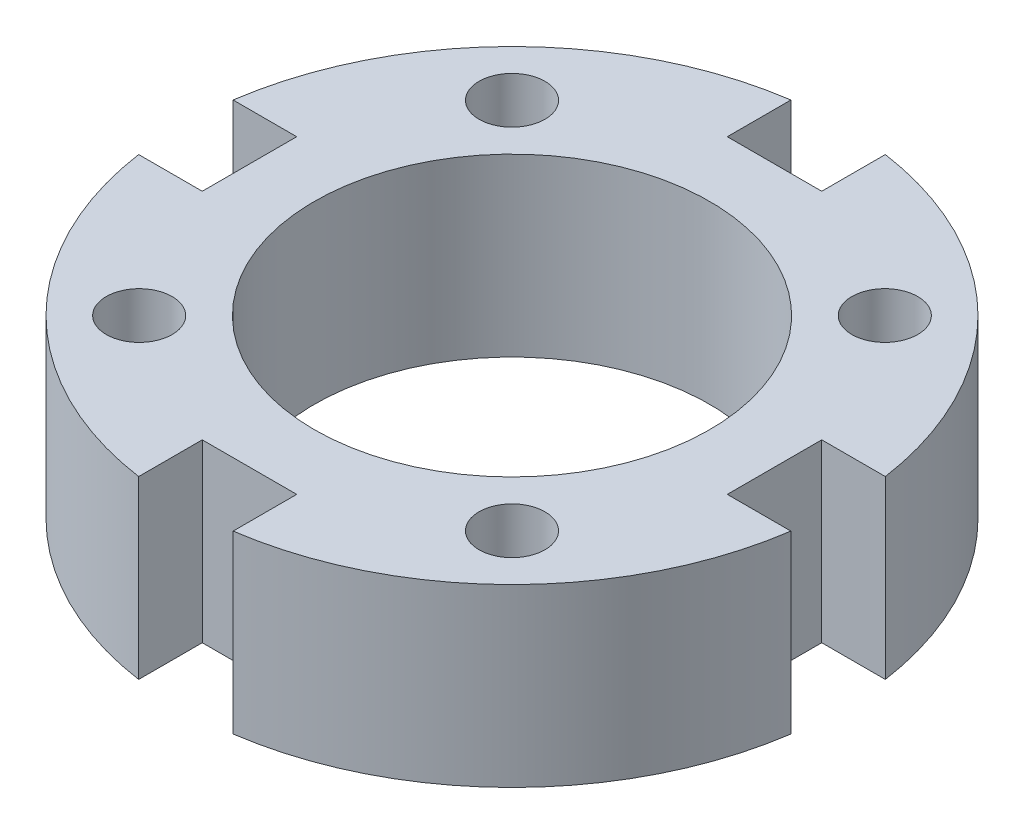
ISO-10303-21;
HEADER;
FILE_DESCRIPTION(('STEP AP214'),'2;1');
FILE_NAME('part.step','',(''),(''),'','','');
FILE_SCHEMA(('AUTOMOTIVE_DESIGN { 1 0 10303 214 1 1 1 1 }'));
ENDSEC;
DATA;
#1=APPLICATION_CONTEXT('core data for automotive mechanical design processes');
#2=APPLICATION_PROTOCOL_DEFINITION('international standard','automotive_design',2000,#1);
#3=PRODUCT_CONTEXT('',#1,'mechanical');
#4=PRODUCT('Part','Part','',(#3));
#5=PRODUCT_RELATED_PRODUCT_CATEGORY('part','',(#4));
#6=PRODUCT_DEFINITION_FORMATION('','',#4);
#7=PRODUCT_DEFINITION_CONTEXT('part definition',#1,'design');
#8=PRODUCT_DEFINITION('design','',#6,#7);
#9=PRODUCT_DEFINITION_SHAPE('','',#8);
#10=(LENGTH_UNIT() NAMED_UNIT(*) SI_UNIT(.MILLI.,.METRE.));
#11=(NAMED_UNIT(*) PLANE_ANGLE_UNIT() SI_UNIT($,.RADIAN.));
#12=(NAMED_UNIT(*) SI_UNIT($,.STERADIAN.) SOLID_ANGLE_UNIT());
#13=UNCERTAINTY_MEASURE_WITH_UNIT(LENGTH_MEASURE(1.E-05),#10,'distance_accuracy_value','');
#14=(GEOMETRIC_REPRESENTATION_CONTEXT(3) GLOBAL_UNCERTAINTY_ASSIGNED_CONTEXT((#13)) GLOBAL_UNIT_ASSIGNED_CONTEXT((#10,
#11,#12)) REPRESENTATION_CONTEXT('',''));
#15=CARTESIAN_POINT('',(0.,0.,0.));
#16=DIRECTION('',(0.,0.,1.));
#17=DIRECTION('',(1.,0.,0.));
#18=AXIS2_PLACEMENT_3D('',#15,#16,#17);
#19=CARTESIAN_POINT('',(0.,4.,0.));
#20=DIRECTION('',(0.,1.,0.));
#21=DIRECTION('',(0.,0.,1.));
#22=AXIS2_PLACEMENT_3D('',#19,#20,#21);
#23=PLANE('',#22);
#24=CARTESIAN_POINT('',(4.24264068711925,4.,-4.24264068711932));
#25=DIRECTION('',(0.,-1.,0.));
#26=DIRECTION('',(-1.,0.,0.));
#27=AXIS2_PLACEMENT_3D('',#24,#25,#26);
#28=CIRCLE('',#27,0.749999999999997);
#29=CARTESIAN_POINT('',(3.49264068711925,4.,-4.24264068711932));
#30=VERTEX_POINT('',#29);
#31=EDGE_CURVE('E383',#30,#30,#28,.T.);
#32=ORIENTED_EDGE('',*,*,#31,.T.);
#33=EDGE_LOOP('',(#32));
#34=FACE_BOUND('',#33,.T.);
#35=CARTESIAN_POINT('',(-4.24264068711931,4.,-4.24264068711926));
#36=DIRECTION('',(0.,-1.,0.));
#37=DIRECTION('',(0.,0.,1.));
#38=AXIS2_PLACEMENT_3D('',#35,#36,#37);
#39=CIRCLE('',#38,0.749999999999997);
#40=CARTESIAN_POINT('',(-4.24264068711931,4.,-3.49264068711927));
#41=VERTEX_POINT('',#40);
#42=EDGE_CURVE('E387',#41,#41,#39,.T.);
#43=ORIENTED_EDGE('',*,*,#42,.T.);
#44=EDGE_LOOP('',(#43));
#45=FACE_BOUND('',#44,.T.);
#46=CARTESIAN_POINT('',(-4.24264068711922,4.,4.24264068711935));
#47=DIRECTION('',(0.,-1.,0.));
#48=DIRECTION('',(1.,0.,0.));
#49=AXIS2_PLACEMENT_3D('',#46,#47,#48);
#50=CIRCLE('',#49,0.749999999999997);
#51=CARTESIAN_POINT('',(-3.49264068711922,4.,4.24264068711934));
#52=VERTEX_POINT('',#51);
#53=EDGE_CURVE('E397',#52,#52,#50,.T.);
#54=ORIENTED_EDGE('',*,*,#53,.T.);
#55=EDGE_LOOP('',(#54));
#56=FACE_BOUND('',#55,.T.);
#57=CARTESIAN_POINT('',(4.24264068711931,4.,4.24264068711926));
#58=DIRECTION('',(0.,-1.,0.));
#59=DIRECTION('',(0.,0.,-1.));
#60=AXIS2_PLACEMENT_3D('',#57,#58,#59);
#61=CIRCLE('',#60,0.749999999999997);
#62=CARTESIAN_POINT('',(4.24264068711931,4.,3.49264068711927));
#63=VERTEX_POINT('',#62);
#64=EDGE_CURVE('E217',#63,#63,#61,.T.);
#65=ORIENTED_EDGE('',*,*,#64,.T.);
#66=EDGE_LOOP('',(#65));
#67=FACE_BOUND('',#66,.T.);
#68=CARTESIAN_POINT('',(0.,4.,0.));
#69=DIRECTION('',(0.,1.,0.));
#70=DIRECTION('',(0.,0.,1.));
#71=AXIS2_PLACEMENT_3D('',#68,#69,#70);
#72=CIRCLE('',#71,4.5);
#73=CARTESIAN_POINT('',(0.,4.,4.5));
#74=VERTEX_POINT('',#73);
#75=EDGE_CURVE('E247',#74,#74,#72,.T.);
#76=ORIENTED_EDGE('',*,*,#75,.F.);
#77=EDGE_LOOP('',(#76));
#78=FACE_BOUND('',#77,.T.);
#79=CARTESIAN_POINT('',(0.,4.,0.));
#80=DIRECTION('',(0.,1.,0.));
#81=DIRECTION('',(0.,0.,1.));
#82=AXIS2_PLACEMENT_3D('',#79,#80,#81);
#83=CIRCLE('',#82,7.5);
#84=CARTESIAN_POINT('',(1.075,4.,7.42255852115697));
#85=VERTEX_POINT('',#84);
#86=CARTESIAN_POINT('',(7.42255852115698,4.,1.07499999999997));
#87=VERTEX_POINT('',#86);
#88=EDGE_CURVE('E253',#85,#87,#83,.T.);
#89=ORIENTED_EDGE('',*,*,#88,.T.);
#90=DIRECTION('',(1.,0.,0.));
#91=VECTOR('',#90,1.);
#92=CARTESIAN_POINT('',(5.97499999997551,4.,1.07499999999998));
#93=LINE('',#92,#91);
#94=CARTESIAN_POINT('',(5.97499999997551,4.,1.07499999999998));
#95=VERTEX_POINT('',#94);
#96=EDGE_CURVE('E174',#95,#87,#93,.T.);
#97=ORIENTED_EDGE('',*,*,#96,.F.);
#98=DIRECTION('',(0.,0.,-1.));
#99=VECTOR('',#98,1.);
#100=CARTESIAN_POINT('',(5.97499999997551,4.,1.07499999999998));
#101=LINE('',#100,#99);
#102=CARTESIAN_POINT('',(5.9749999999755,4.,-1.07500000000002));
#103=VERTEX_POINT('',#102);
#104=EDGE_CURVE('E173',#95,#103,#101,.T.);
#105=ORIENTED_EDGE('',*,*,#104,.T.);
#106=DIRECTION('',(1.,0.,0.));
#107=VECTOR('',#106,1.);
#108=CARTESIAN_POINT('',(5.9749999999755,4.,-1.07500000000002));
#109=LINE('',#108,#107);
#110=CARTESIAN_POINT('',(7.42255852115697,4.,-1.07500000000003));
#111=VERTEX_POINT('',#110);
#112=EDGE_CURVE('E165',#103,#111,#109,.T.);
#113=ORIENTED_EDGE('',*,*,#112,.T.);
#114=CARTESIAN_POINT('',(1.075,4.,-7.42255852115697));
#115=VERTEX_POINT('',#114);
#116=EDGE_CURVE('E257',#111,#115,#83,.T.);
#117=ORIENTED_EDGE('',*,*,#116,.T.);
#118=DIRECTION('',(0.,0.,-1.));
#119=VECTOR('',#118,1.);
#120=CARTESIAN_POINT('',(1.075,4.,-5.97499999997551));
#121=LINE('',#120,#119);
#122=CARTESIAN_POINT('',(1.075,4.,-5.97499999997551));
#123=VERTEX_POINT('',#122);
#124=EDGE_CURVE('E192',#123,#115,#121,.T.);
#125=ORIENTED_EDGE('',*,*,#124,.F.);
#126=DIRECTION('',(-1.,0.,0.));
#127=VECTOR('',#126,1.);
#128=CARTESIAN_POINT('',(1.075,4.,-5.97499999997551));
#129=LINE('',#128,#127);
#130=CARTESIAN_POINT('',(-1.075,4.,-5.97499999997551));
#131=VERTEX_POINT('',#130);
#132=EDGE_CURVE('E202',#123,#131,#129,.T.);
#133=ORIENTED_EDGE('',*,*,#132,.T.);
#134=DIRECTION('',(0.,0.,-1.));
#135=VECTOR('',#134,1.);
#136=CARTESIAN_POINT('',(-1.075,4.,-5.97499999997551));
#137=LINE('',#136,#135);
#138=CARTESIAN_POINT('',(-1.075,4.,-7.42255852115697));
#139=VERTEX_POINT('',#138);
#140=EDGE_CURVE('E189',#131,#139,#137,.T.);
#141=ORIENTED_EDGE('',*,*,#140,.T.);
#142=CARTESIAN_POINT('',(-7.42255852115698,4.,-1.07499999999992));
#143=VERTEX_POINT('',#142);
#144=EDGE_CURVE('E410',#139,#143,#83,.T.);
#145=ORIENTED_EDGE('',*,*,#144,.T.);
#146=DIRECTION('',(-1.,0.,0.));
#147=VECTOR('',#146,1.);
#148=CARTESIAN_POINT('',(-5.97499999997552,4.,-1.07499999999994));
#149=LINE('',#148,#147);
#150=CARTESIAN_POINT('',(-5.97499999997552,4.,-1.07499999999994));
#151=VERTEX_POINT('',#150);
#152=EDGE_CURVE('E212',#151,#143,#149,.T.);
#153=ORIENTED_EDGE('',*,*,#152,.F.);
#154=DIRECTION('',(0.,0.,1.));
#155=VECTOR('',#154,1.);
#156=CARTESIAN_POINT('',(-5.97499999997552,4.,-1.07499999999994));
#157=LINE('',#156,#155);
#158=CARTESIAN_POINT('',(-5.9749999999755,4.,1.07500000000006));
#159=VERTEX_POINT('',#158);
#160=EDGE_CURVE('E197',#151,#159,#157,.T.);
#161=ORIENTED_EDGE('',*,*,#160,.T.);
#162=DIRECTION('',(-1.,0.,0.));
#163=VECTOR('',#162,1.);
#164=CARTESIAN_POINT('',(-5.9749999999755,4.,1.07500000000006));
#165=LINE('',#164,#163);
#166=CARTESIAN_POINT('',(-7.42255852115696,4.,1.07500000000008));
#167=VERTEX_POINT('',#166);
#168=EDGE_CURVE('E209',#159,#167,#165,.T.);
#169=ORIENTED_EDGE('',*,*,#168,.T.);
#170=CARTESIAN_POINT('',(-1.075,4.,7.42255852115697));
#171=VERTEX_POINT('',#170);
#172=EDGE_CURVE('E258',#167,#171,#83,.T.);
#173=ORIENTED_EDGE('',*,*,#172,.T.);
#174=DIRECTION('',(0.,0.,1.));
#175=VECTOR('',#174,1.);
#176=CARTESIAN_POINT('',(-1.075,4.,5.97499999997551));
#177=LINE('',#176,#175);
#178=CARTESIAN_POINT('',(-1.075,4.,5.97499999997551));
#179=VERTEX_POINT('',#178);
#180=EDGE_CURVE('E231',#179,#171,#177,.T.);
#181=ORIENTED_EDGE('',*,*,#180,.F.);
#182=DIRECTION('',(1.,0.,0.));
#183=VECTOR('',#182,1.);
#184=CARTESIAN_POINT('',(-1.075,4.,5.97499999997551));
#185=LINE('',#184,#183);
#186=CARTESIAN_POINT('',(1.075,4.,5.97499999997551));
#187=VERTEX_POINT('',#186);
#188=EDGE_CURVE('E242',#179,#187,#185,.T.);
#189=ORIENTED_EDGE('',*,*,#188,.T.);
#190=DIRECTION('',(0.,0.,1.));
#191=VECTOR('',#190,1.);
#192=CARTESIAN_POINT('',(1.075,4.,5.97499999997551));
#193=LINE('',#192,#191);
#194=EDGE_CURVE('E228',#187,#85,#193,.T.);
#195=ORIENTED_EDGE('',*,*,#194,.T.);
#196=EDGE_LOOP('',(#89,#97,#105,#113,#117,#125,#133,#141,#145,#153,#161,#169,#173,#181,#189,#195));
#197=FACE_BOUND('',#196,.T.);
#198=ADVANCED_FACE('F41',(#34,#45,#56,#67,#78,#197),#23,.T.);
#199=CARTESIAN_POINT('',(0.,0.,0.));
#200=DIRECTION('',(0.,1.,0.));
#201=DIRECTION('',(0.,0.,1.));
#202=AXIS2_PLACEMENT_3D('',#199,#200,#201);
#203=PLANE('',#202);
#204=CARTESIAN_POINT('',(4.24264068711925,0.,-4.24264068711932));
#205=DIRECTION('',(0.,-1.,0.));
#206=DIRECTION('',(-1.,0.,0.));
#207=AXIS2_PLACEMENT_3D('',#204,#205,#206);
#208=CIRCLE('',#207,0.749999999999997);
#209=CARTESIAN_POINT('',(3.49264068711925,0.,-4.24264068711932));
#210=VERTEX_POINT('',#209);
#211=EDGE_CURVE('E386',#210,#210,#208,.T.);
#212=ORIENTED_EDGE('',*,*,#211,.F.);
#213=EDGE_LOOP('',(#212));
#214=FACE_BOUND('',#213,.T.);
#215=CARTESIAN_POINT('',(-4.24264068711931,0.,-4.24264068711926));
#216=DIRECTION('',(0.,-1.,0.));
#217=DIRECTION('',(0.,0.,1.));
#218=AXIS2_PLACEMENT_3D('',#215,#216,#217);
#219=CIRCLE('',#218,0.749999999999997);
#220=CARTESIAN_POINT('',(-4.24264068711931,0.,-3.49264068711927));
#221=VERTEX_POINT('',#220);
#222=EDGE_CURVE('E392',#221,#221,#219,.T.);
#223=ORIENTED_EDGE('',*,*,#222,.F.);
#224=EDGE_LOOP('',(#223));
#225=FACE_BOUND('',#224,.T.);
#226=CARTESIAN_POINT('',(-4.24264068711922,0.,4.24264068711935));
#227=DIRECTION('',(0.,-1.,0.));
#228=DIRECTION('',(1.,0.,0.));
#229=AXIS2_PLACEMENT_3D('',#226,#227,#228);
#230=CIRCLE('',#229,0.749999999999997);
#231=CARTESIAN_POINT('',(-3.49264068711922,0.,4.24264068711934));
#232=VERTEX_POINT('',#231);
#233=EDGE_CURVE('E400',#232,#232,#230,.T.);
#234=ORIENTED_EDGE('',*,*,#233,.F.);
#235=EDGE_LOOP('',(#234));
#236=FACE_BOUND('',#235,.T.);
#237=CARTESIAN_POINT('',(4.24264068711931,0.,4.24264068711926));
#238=DIRECTION('',(0.,-1.,0.));
#239=DIRECTION('',(0.,0.,-1.));
#240=AXIS2_PLACEMENT_3D('',#237,#238,#239);
#241=CIRCLE('',#240,0.749999999999997);
#242=CARTESIAN_POINT('',(4.24264068711931,0.,3.49264068711927));
#243=VERTEX_POINT('',#242);
#244=EDGE_CURVE('E389',#243,#243,#241,.T.);
#245=ORIENTED_EDGE('',*,*,#244,.F.);
#246=EDGE_LOOP('',(#245));
#247=FACE_BOUND('',#246,.T.);
#248=CARTESIAN_POINT('',(0.,0.,0.));
#249=DIRECTION('',(0.,1.,0.));
#250=DIRECTION('',(0.,0.,1.));
#251=AXIS2_PLACEMENT_3D('',#248,#249,#250);
#252=CIRCLE('',#251,4.5);
#253=CARTESIAN_POINT('',(0.,0.,4.5));
#254=VERTEX_POINT('',#253);
#255=EDGE_CURVE('E245',#254,#254,#252,.T.);
#256=ORIENTED_EDGE('',*,*,#255,.T.);
#257=EDGE_LOOP('',(#256));
#258=FACE_BOUND('',#257,.T.);
#259=DIRECTION('',(-1.,0.,0.));
#260=VECTOR('',#259,1.);
#261=CARTESIAN_POINT('',(7.49999999997551,0.,1.07499999999997));
#262=LINE('',#261,#260);
#263=CARTESIAN_POINT('',(7.42255852115698,0.,1.07499999999997));
#264=VERTEX_POINT('',#263);
#265=CARTESIAN_POINT('',(5.97499999997551,0.,1.07499999999998));
#266=VERTEX_POINT('',#265);
#267=EDGE_CURVE('E155',#264,#266,#262,.T.);
#268=ORIENTED_EDGE('',*,*,#267,.F.);
#269=CARTESIAN_POINT('',(0.,0.,0.));
#270=DIRECTION('',(0.,1.,0.));
#271=DIRECTION('',(0.,0.,1.));
#272=AXIS2_PLACEMENT_3D('',#269,#270,#271);
#273=CIRCLE('',#272,7.5);
#274=CARTESIAN_POINT('',(1.075,0.,7.42255852115697));
#275=VERTEX_POINT('',#274);
#276=EDGE_CURVE('E259',#275,#264,#273,.T.);
#277=ORIENTED_EDGE('',*,*,#276,.F.);
#278=DIRECTION('',(0.,0.,-1.));
#279=VECTOR('',#278,1.);
#280=CARTESIAN_POINT('',(1.075,0.,7.49999999997551));
#281=LINE('',#280,#279);
#282=CARTESIAN_POINT('',(1.075,0.,5.97499999997551));
#283=VERTEX_POINT('',#282);
#284=EDGE_CURVE('E181',#275,#283,#281,.T.);
#285=ORIENTED_EDGE('',*,*,#284,.T.);
#286=DIRECTION('',(1.,0.,0.));
#287=VECTOR('',#286,1.);
#288=CARTESIAN_POINT('',(-1.075,0.,5.97499999997551));
#289=LINE('',#288,#287);
#290=CARTESIAN_POINT('',(-1.075,0.,5.97499999997551));
#291=VERTEX_POINT('',#290);
#292=EDGE_CURVE('E234',#291,#283,#289,.T.);
#293=ORIENTED_EDGE('',*,*,#292,.F.);
#294=DIRECTION('',(0.,0.,-1.));
#295=VECTOR('',#294,1.);
#296=CARTESIAN_POINT('',(-1.075,0.,7.49999999997551));
#297=LINE('',#296,#295);
#298=CARTESIAN_POINT('',(-1.075,0.,7.42255852115697));
#299=VERTEX_POINT('',#298);
#300=EDGE_CURVE('E225',#299,#291,#297,.T.);
#301=ORIENTED_EDGE('',*,*,#300,.F.);
#302=CARTESIAN_POINT('',(-7.42255852115696,0.,1.07500000000008));
#303=VERTEX_POINT('',#302);
#304=EDGE_CURVE('E250',#303,#299,#273,.T.);
#305=ORIENTED_EDGE('',*,*,#304,.F.);
#306=DIRECTION('',(1.,0.,0.));
#307=VECTOR('',#306,1.);
#308=CARTESIAN_POINT('',(-7.4999999999755,0.,1.07500000000008));
#309=LINE('',#308,#307);
#310=CARTESIAN_POINT('',(-5.9749999999755,0.,1.07500000000006));
#311=VERTEX_POINT('',#310);
#312=EDGE_CURVE('E56',#303,#311,#309,.T.);
#313=ORIENTED_EDGE('',*,*,#312,.T.);
#314=DIRECTION('',(0.,0.,1.));
#315=VECTOR('',#314,1.);
#316=CARTESIAN_POINT('',(-5.97499999997552,0.,-1.07499999999994));
#317=LINE('',#316,#315);
#318=CARTESIAN_POINT('',(-5.97499999997552,0.,-1.07499999999994));
#319=VERTEX_POINT('',#318);
#320=EDGE_CURVE('E214',#319,#311,#317,.T.);
#321=ORIENTED_EDGE('',*,*,#320,.F.);
#322=DIRECTION('',(1.,0.,0.));
#323=VECTOR('',#322,1.);
#324=CARTESIAN_POINT('',(-7.49999999997552,0.,-1.07499999999992));
#325=LINE('',#324,#323);
#326=CARTESIAN_POINT('',(-7.42255852115698,0.,-1.07499999999992));
#327=VERTEX_POINT('',#326);
#328=EDGE_CURVE('E206',#327,#319,#325,.T.);
#329=ORIENTED_EDGE('',*,*,#328,.F.);
#330=CARTESIAN_POINT('',(-1.075,0.,-7.42255852115697));
#331=VERTEX_POINT('',#330);
#332=EDGE_CURVE('E285',#331,#327,#273,.T.);
#333=ORIENTED_EDGE('',*,*,#332,.F.);
#334=DIRECTION('',(0.,0.,1.));
#335=VECTOR('',#334,1.);
#336=CARTESIAN_POINT('',(-1.075,0.,-7.49999999997551));
#337=LINE('',#336,#335);
#338=CARTESIAN_POINT('',(-1.075,0.,-5.97499999997551));
#339=VERTEX_POINT('',#338);
#340=EDGE_CURVE('E64',#331,#339,#337,.T.);
#341=ORIENTED_EDGE('',*,*,#340,.T.);
#342=DIRECTION('',(-1.,0.,0.));
#343=VECTOR('',#342,1.);
#344=CARTESIAN_POINT('',(1.075,0.,-5.97499999997551));
#345=LINE('',#344,#343);
#346=CARTESIAN_POINT('',(1.075,0.,-5.97499999997551));
#347=VERTEX_POINT('',#346);
#348=EDGE_CURVE('E194',#347,#339,#345,.T.);
#349=ORIENTED_EDGE('',*,*,#348,.F.);
#350=DIRECTION('',(0.,0.,1.));
#351=VECTOR('',#350,1.);
#352=CARTESIAN_POINT('',(1.075,0.,-7.49999999997551));
#353=LINE('',#352,#351);
#354=CARTESIAN_POINT('',(1.075,0.,-7.42255852115697));
#355=VERTEX_POINT('',#354);
#356=EDGE_CURVE('E186',#355,#347,#353,.T.);
#357=ORIENTED_EDGE('',*,*,#356,.F.);
#358=CARTESIAN_POINT('',(7.42255852115697,0.,-1.07500000000003));
#359=VERTEX_POINT('',#358);
#360=EDGE_CURVE('E261',#359,#355,#273,.T.);
#361=ORIENTED_EDGE('',*,*,#360,.F.);
#362=DIRECTION('',(-1.,0.,0.));
#363=VECTOR('',#362,1.);
#364=CARTESIAN_POINT('',(7.4999999999755,0.,-1.07500000000003));
#365=LINE('',#364,#363);
#366=CARTESIAN_POINT('',(5.9749999999755,0.,-1.07500000000002));
#367=VERTEX_POINT('',#366);
#368=EDGE_CURVE('E179',#359,#367,#365,.T.);
#369=ORIENTED_EDGE('',*,*,#368,.T.);
#370=DIRECTION('',(0.,0.,-1.));
#371=VECTOR('',#370,1.);
#372=CARTESIAN_POINT('',(5.97499999997551,0.,1.07499999999998));
#373=LINE('',#372,#371);
#374=EDGE_CURVE('E170',#266,#367,#373,.T.);
#375=ORIENTED_EDGE('',*,*,#374,.F.);
#376=EDGE_LOOP('',(#268,#277,#285,#293,#301,#305,#313,#321,#329,#333,#341,#349,#357,#361,#369,#375));
#377=FACE_BOUND('',#376,.T.);
#378=ADVANCED_FACE('F177',(#214,#225,#236,#247,#258,#377),#203,.F.);
#379=CARTESIAN_POINT('',(0.,4.,0.));
#380=DIRECTION('',(0.,-1.,0.));
#381=DIRECTION('',(0.,0.,-1.));
#382=AXIS2_PLACEMENT_3D('',#379,#380,#381);
#383=CYLINDRICAL_SURFACE('',#382,7.5);
#384=DIRECTION('',(0.,-1.,0.));
#385=VECTOR('',#384,1.);
#386=CARTESIAN_POINT('',(7.42255852115698,4.,1.07499999999997));
#387=LINE('',#386,#385);
#388=EDGE_CURVE('E12',#87,#264,#387,.T.);
#389=ORIENTED_EDGE('',*,*,#388,.F.);
#390=ORIENTED_EDGE('',*,*,#88,.F.);
#391=DIRECTION('',(0.,-1.,0.));
#392=VECTOR('',#391,1.);
#393=CARTESIAN_POINT('',(1.075,4.,7.42255852115697));
#394=LINE('',#393,#392);
#395=EDGE_CURVE('E256',#85,#275,#394,.T.);
#396=ORIENTED_EDGE('',*,*,#395,.T.);
#397=ORIENTED_EDGE('',*,*,#276,.T.);
#398=EDGE_LOOP('',(#389,#390,#396,#397));
#399=FACE_BOUND('',#398,.T.);
#400=ADVANCED_FACE('F308',(#399),#383,.T.);
#401=ORIENTED_EDGE('',*,*,#116,.F.);
#402=DIRECTION('',(0.,-1.,0.));
#403=VECTOR('',#402,1.);
#404=CARTESIAN_POINT('',(7.42255852115697,4.,-1.07500000000003));
#405=LINE('',#404,#403);
#406=EDGE_CURVE('E49',#111,#359,#405,.T.);
#407=ORIENTED_EDGE('',*,*,#406,.T.);
#408=ORIENTED_EDGE('',*,*,#360,.T.);
#409=DIRECTION('',(0.,-1.,0.));
#410=VECTOR('',#409,1.);
#411=CARTESIAN_POINT('',(1.075,4.,-7.42255852115697));
#412=LINE('',#411,#410);
#413=EDGE_CURVE('E273',#115,#355,#412,.T.);
#414=ORIENTED_EDGE('',*,*,#413,.F.);
#415=EDGE_LOOP('',(#401,#407,#408,#414));
#416=FACE_BOUND('',#415,.T.);
#417=ADVANCED_FACE('F278',(#416),#383,.T.);
#418=ORIENTED_EDGE('',*,*,#144,.F.);
#419=DIRECTION('',(0.,-1.,0.));
#420=VECTOR('',#419,1.);
#421=CARTESIAN_POINT('',(-1.075,4.,-7.42255852115697));
#422=LINE('',#421,#420);
#423=EDGE_CURVE('E271',#139,#331,#422,.T.);
#424=ORIENTED_EDGE('',*,*,#423,.T.);
#425=ORIENTED_EDGE('',*,*,#332,.T.);
#426=DIRECTION('',(0.,-1.,0.));
#427=VECTOR('',#426,1.);
#428=CARTESIAN_POINT('',(-7.42255852115698,4.,-1.07499999999992));
#429=LINE('',#428,#427);
#430=EDGE_CURVE('E269',#143,#327,#429,.T.);
#431=ORIENTED_EDGE('',*,*,#430,.F.);
#432=EDGE_LOOP('',(#418,#424,#425,#431));
#433=FACE_BOUND('',#432,.T.);
#434=ADVANCED_FACE('F314',(#433),#383,.T.);
#435=ORIENTED_EDGE('',*,*,#172,.F.);
#436=DIRECTION('',(0.,-1.,0.));
#437=VECTOR('',#436,1.);
#438=CARTESIAN_POINT('',(-7.42255852115696,4.,1.07500000000008));
#439=LINE('',#438,#437);
#440=EDGE_CURVE('E267',#167,#303,#439,.T.);
#441=ORIENTED_EDGE('',*,*,#440,.T.);
#442=ORIENTED_EDGE('',*,*,#304,.T.);
#443=DIRECTION('',(0.,-1.,0.));
#444=VECTOR('',#443,1.);
#445=CARTESIAN_POINT('',(-1.075,4.,7.42255852115697));
#446=LINE('',#445,#444);
#447=EDGE_CURVE('E264',#171,#299,#446,.T.);
#448=ORIENTED_EDGE('',*,*,#447,.F.);
#449=EDGE_LOOP('',(#435,#441,#442,#448));
#450=FACE_BOUND('',#449,.T.);
#451=ADVANCED_FACE('F43',(#450),#383,.T.);
#452=CARTESIAN_POINT('',(0.,4.,0.));
#453=DIRECTION('',(0.,-1.,0.));
#454=DIRECTION('',(0.,0.,-1.));
#455=AXIS2_PLACEMENT_3D('',#452,#453,#454);
#456=CYLINDRICAL_SURFACE('',#455,4.5);
#457=ORIENTED_EDGE('',*,*,#75,.T.);
#458=EDGE_LOOP('',(#457));
#459=FACE_BOUND('',#458,.T.);
#460=ORIENTED_EDGE('',*,*,#255,.F.);
#461=EDGE_LOOP('',(#460));
#462=FACE_BOUND('',#461,.T.);
#463=ADVANCED_FACE('F317',(#459,#462),#456,.F.);
#464=CARTESIAN_POINT('',(-1.075,0.,0.));
#465=DIRECTION('',(1.,0.,0.));
#466=DIRECTION('',(0.,0.,-1.));
#467=AXIS2_PLACEMENT_3D('',#464,#465,#466);
#468=PLANE('',#467);
#469=ORIENTED_EDGE('',*,*,#447,.T.);
#470=ORIENTED_EDGE('',*,*,#300,.T.);
#471=DIRECTION('',(0.,1.,0.));
#472=VECTOR('',#471,1.);
#473=CARTESIAN_POINT('',(-1.075,0.,5.97499999997551));
#474=LINE('',#473,#472);
#475=EDGE_CURVE('E227',#291,#179,#474,.T.);
#476=ORIENTED_EDGE('',*,*,#475,.T.);
#477=ORIENTED_EDGE('',*,*,#180,.T.);
#478=EDGE_LOOP('',(#469,#470,#476,#477));
#479=FACE_BOUND('',#478,.T.);
#480=ADVANCED_FACE('F296',(#479),#468,.T.);
#481=CARTESIAN_POINT('',(1.075,0.,0.));
#482=DIRECTION('',(1.,0.,0.));
#483=DIRECTION('',(0.,0.,-1.));
#484=AXIS2_PLACEMENT_3D('',#481,#482,#483);
#485=PLANE('',#484);
#486=ORIENTED_EDGE('',*,*,#194,.F.);
#487=DIRECTION('',(0.,1.,0.));
#488=VECTOR('',#487,1.);
#489=CARTESIAN_POINT('',(1.075,0.,5.97499999997551));
#490=LINE('',#489,#488);
#491=EDGE_CURVE('E237',#283,#187,#490,.T.);
#492=ORIENTED_EDGE('',*,*,#491,.F.);
#493=ORIENTED_EDGE('',*,*,#284,.F.);
#494=ORIENTED_EDGE('',*,*,#395,.F.);
#495=EDGE_LOOP('',(#486,#492,#493,#494));
#496=FACE_BOUND('',#495,.T.);
#497=ADVANCED_FACE('F304',(#496),#485,.F.);
#498=CARTESIAN_POINT('',(-1.075,0.,5.97499999997551));
#499=DIRECTION('',(0.,0.,-1.));
#500=DIRECTION('',(-1.,0.,0.));
#501=AXIS2_PLACEMENT_3D('',#498,#499,#500);
#502=PLANE('',#501);
#503=ORIENTED_EDGE('',*,*,#491,.T.);
#504=ORIENTED_EDGE('',*,*,#188,.F.);
#505=ORIENTED_EDGE('',*,*,#475,.F.);
#506=ORIENTED_EDGE('',*,*,#292,.T.);
#507=EDGE_LOOP('',(#503,#504,#505,#506));
#508=FACE_BOUND('',#507,.T.);
#509=ADVANCED_FACE('F302',(#508),#502,.F.);
#510=CARTESIAN_POINT('',(0.,0.,-1.075));
#511=DIRECTION('',(0.,0.,1.));
#512=DIRECTION('',(1.,0.,0.));
#513=AXIS2_PLACEMENT_3D('',#510,#511,#512);
#514=PLANE('',#513);
#515=ORIENTED_EDGE('',*,*,#430,.T.);
#516=ORIENTED_EDGE('',*,*,#328,.T.);
#517=DIRECTION('',(0.,1.,0.));
#518=VECTOR('',#517,1.);
#519=CARTESIAN_POINT('',(-5.97499999997552,0.,-1.07499999999994));
#520=LINE('',#519,#518);
#521=EDGE_CURVE('E208',#319,#151,#520,.T.);
#522=ORIENTED_EDGE('',*,*,#521,.T.);
#523=ORIENTED_EDGE('',*,*,#152,.T.);
#524=EDGE_LOOP('',(#515,#516,#522,#523));
#525=FACE_BOUND('',#524,.T.);
#526=ADVANCED_FACE('F331',(#525),#514,.T.);
#527=CARTESIAN_POINT('',(0.,0.,1.075));
#528=DIRECTION('',(0.,0.,1.));
#529=DIRECTION('',(1.,0.,0.));
#530=AXIS2_PLACEMENT_3D('',#527,#528,#529);
#531=PLANE('',#530);
#532=ORIENTED_EDGE('',*,*,#168,.F.);
#533=DIRECTION('',(0.,1.,0.));
#534=VECTOR('',#533,1.);
#535=CARTESIAN_POINT('',(-5.9749999999755,0.,1.07500000000006));
#536=LINE('',#535,#534);
#537=EDGE_CURVE('E216',#311,#159,#536,.T.);
#538=ORIENTED_EDGE('',*,*,#537,.F.);
#539=ORIENTED_EDGE('',*,*,#312,.F.);
#540=ORIENTED_EDGE('',*,*,#440,.F.);
#541=EDGE_LOOP('',(#532,#538,#539,#540));
#542=FACE_BOUND('',#541,.T.);
#543=ADVANCED_FACE('F340',(#542),#531,.F.);
#544=CARTESIAN_POINT('',(-5.97499999997552,0.,-1.07499999999994));
#545=DIRECTION('',(1.,0.,0.));
#546=DIRECTION('',(0.,0.,-1.));
#547=AXIS2_PLACEMENT_3D('',#544,#545,#546);
#548=PLANE('',#547);
#549=ORIENTED_EDGE('',*,*,#537,.T.);
#550=ORIENTED_EDGE('',*,*,#160,.F.);
#551=ORIENTED_EDGE('',*,*,#521,.F.);
#552=ORIENTED_EDGE('',*,*,#320,.T.);
#553=EDGE_LOOP('',(#549,#550,#551,#552));
#554=FACE_BOUND('',#553,.T.);
#555=ADVANCED_FACE('F336',(#554),#548,.F.);
#556=CARTESIAN_POINT('',(1.075,0.,0.));
#557=DIRECTION('',(-1.,0.,0.));
#558=DIRECTION('',(0.,0.,1.));
#559=AXIS2_PLACEMENT_3D('',#556,#557,#558);
#560=PLANE('',#559);
#561=ORIENTED_EDGE('',*,*,#413,.T.);
#562=ORIENTED_EDGE('',*,*,#356,.T.);
#563=DIRECTION('',(0.,1.,0.));
#564=VECTOR('',#563,1.);
#565=CARTESIAN_POINT('',(1.075,0.,-5.97499999997551));
#566=LINE('',#565,#564);
#567=EDGE_CURVE('E188',#347,#123,#566,.T.);
#568=ORIENTED_EDGE('',*,*,#567,.T.);
#569=ORIENTED_EDGE('',*,*,#124,.T.);
#570=EDGE_LOOP('',(#561,#562,#568,#569));
#571=FACE_BOUND('',#570,.T.);
#572=ADVANCED_FACE('F339',(#571),#560,.T.);
#573=CARTESIAN_POINT('',(-1.075,0.,0.));
#574=DIRECTION('',(-1.,0.,0.));
#575=DIRECTION('',(0.,0.,1.));
#576=AXIS2_PLACEMENT_3D('',#573,#574,#575);
#577=PLANE('',#576);
#578=ORIENTED_EDGE('',*,*,#140,.F.);
#579=DIRECTION('',(0.,1.,0.));
#580=VECTOR('',#579,1.);
#581=CARTESIAN_POINT('',(-1.075,0.,-5.97499999997551));
#582=LINE('',#581,#580);
#583=EDGE_CURVE('E196',#339,#131,#582,.T.);
#584=ORIENTED_EDGE('',*,*,#583,.F.);
#585=ORIENTED_EDGE('',*,*,#340,.F.);
#586=ORIENTED_EDGE('',*,*,#423,.F.);
#587=EDGE_LOOP('',(#578,#584,#585,#586));
#588=FACE_BOUND('',#587,.T.);
#589=ADVANCED_FACE('F350',(#588),#577,.F.);
#590=CARTESIAN_POINT('',(1.075,0.,-5.97499999997551));
#591=DIRECTION('',(0.,0.,1.));
#592=DIRECTION('',(1.,0.,0.));
#593=AXIS2_PLACEMENT_3D('',#590,#591,#592);
#594=PLANE('',#593);
#595=ORIENTED_EDGE('',*,*,#583,.T.);
#596=ORIENTED_EDGE('',*,*,#132,.F.);
#597=ORIENTED_EDGE('',*,*,#567,.F.);
#598=ORIENTED_EDGE('',*,*,#348,.T.);
#599=EDGE_LOOP('',(#595,#596,#597,#598));
#600=FACE_BOUND('',#599,.T.);
#601=ADVANCED_FACE('F347',(#600),#594,.F.);
#602=CARTESIAN_POINT('',(0.,0.,1.075));
#603=DIRECTION('',(0.,0.,-1.));
#604=DIRECTION('',(-1.,0.,0.));
#605=AXIS2_PLACEMENT_3D('',#602,#603,#604);
#606=PLANE('',#605);
#607=ORIENTED_EDGE('',*,*,#388,.T.);
#608=ORIENTED_EDGE('',*,*,#267,.T.);
#609=DIRECTION('',(0.,1.,0.));
#610=VECTOR('',#609,1.);
#611=CARTESIAN_POINT('',(5.97499999997551,0.,1.07499999999998));
#612=LINE('',#611,#610);
#613=EDGE_CURVE('E158',#266,#95,#612,.T.);
#614=ORIENTED_EDGE('',*,*,#613,.T.);
#615=ORIENTED_EDGE('',*,*,#96,.T.);
#616=EDGE_LOOP('',(#607,#608,#614,#615));
#617=FACE_BOUND('',#616,.T.);
#618=ADVANCED_FACE('F157',(#617),#606,.T.);
#619=CARTESIAN_POINT('',(0.,0.,-1.075));
#620=DIRECTION('',(0.,0.,-1.));
#621=DIRECTION('',(-1.,0.,0.));
#622=AXIS2_PLACEMENT_3D('',#619,#620,#621);
#623=PLANE('',#622);
#624=ORIENTED_EDGE('',*,*,#112,.F.);
#625=DIRECTION('',(0.,1.,0.));
#626=VECTOR('',#625,1.);
#627=CARTESIAN_POINT('',(5.9749999999755,0.,-1.07500000000002));
#628=LINE('',#627,#626);
#629=EDGE_CURVE('E408',#367,#103,#628,.T.);
#630=ORIENTED_EDGE('',*,*,#629,.F.);
#631=ORIENTED_EDGE('',*,*,#368,.F.);
#632=ORIENTED_EDGE('',*,*,#406,.F.);
#633=EDGE_LOOP('',(#624,#630,#631,#632));
#634=FACE_BOUND('',#633,.T.);
#635=ADVANCED_FACE('F360',(#634),#623,.F.);
#636=CARTESIAN_POINT('',(5.97499999997551,0.,1.07499999999998));
#637=DIRECTION('',(-1.,0.,0.));
#638=DIRECTION('',(0.,0.,1.));
#639=AXIS2_PLACEMENT_3D('',#636,#637,#638);
#640=PLANE('',#639);
#641=ORIENTED_EDGE('',*,*,#629,.T.);
#642=ORIENTED_EDGE('',*,*,#104,.F.);
#643=ORIENTED_EDGE('',*,*,#613,.F.);
#644=ORIENTED_EDGE('',*,*,#374,.T.);
#645=EDGE_LOOP('',(#641,#642,#643,#644));
#646=FACE_BOUND('',#645,.T.);
#647=ADVANCED_FACE('F169',(#646),#640,.F.);
#648=CARTESIAN_POINT('',(4.24264068711931,4.,4.24264068711926));
#649=DIRECTION('',(0.,-1.,0.));
#650=DIRECTION('',(0.,0.,-1.));
#651=AXIS2_PLACEMENT_3D('',#648,#649,#650);
#652=CYLINDRICAL_SURFACE('',#651,0.749999999999997);
#653=ORIENTED_EDGE('',*,*,#64,.F.);
#654=EDGE_LOOP('',(#653));
#655=FACE_BOUND('',#654,.T.);
#656=ORIENTED_EDGE('',*,*,#244,.T.);
#657=EDGE_LOOP('',(#656));
#658=FACE_BOUND('',#657,.T.);
#659=ADVANCED_FACE('F359',(#655,#658),#652,.F.);
#660=CARTESIAN_POINT('',(-4.24264068711922,4.,4.24264068711935));
#661=DIRECTION('',(0.,-1.,0.));
#662=DIRECTION('',(0.,0.,-1.));
#663=AXIS2_PLACEMENT_3D('',#660,#661,#662);
#664=CYLINDRICAL_SURFACE('',#663,0.749999999999997);
#665=ORIENTED_EDGE('',*,*,#53,.F.);
#666=EDGE_LOOP('',(#665));
#667=FACE_BOUND('',#666,.T.);
#668=ORIENTED_EDGE('',*,*,#233,.T.);
#669=EDGE_LOOP('',(#668));
#670=FACE_BOUND('',#669,.T.);
#671=ADVANCED_FACE('F367',(#667,#670),#664,.F.);
#672=CARTESIAN_POINT('',(-4.24264068711931,4.,-4.24264068711926));
#673=DIRECTION('',(0.,-1.,0.));
#674=DIRECTION('',(0.,0.,-1.));
#675=AXIS2_PLACEMENT_3D('',#672,#673,#674);
#676=CYLINDRICAL_SURFACE('',#675,0.749999999999997);
#677=ORIENTED_EDGE('',*,*,#42,.F.);
#678=EDGE_LOOP('',(#677));
#679=FACE_BOUND('',#678,.T.);
#680=ORIENTED_EDGE('',*,*,#222,.T.);
#681=EDGE_LOOP('',(#680));
#682=FACE_BOUND('',#681,.T.);
#683=ADVANCED_FACE('F371',(#679,#682),#676,.F.);
#684=CARTESIAN_POINT('',(4.24264068711925,4.,-4.24264068711932));
#685=DIRECTION('',(0.,-1.,0.));
#686=DIRECTION('',(0.,0.,-1.));
#687=AXIS2_PLACEMENT_3D('',#684,#685,#686);
#688=CYLINDRICAL_SURFACE('',#687,0.749999999999997);
#689=ORIENTED_EDGE('',*,*,#31,.F.);
#690=EDGE_LOOP('',(#689));
#691=FACE_BOUND('',#690,.T.);
#692=ORIENTED_EDGE('',*,*,#211,.T.);
#693=EDGE_LOOP('',(#692));
#694=FACE_BOUND('',#693,.T.);
#695=ADVANCED_FACE('F375',(#691,#694),#688,.F.);
#696=CLOSED_SHELL('',(#198,#378,#400,#417,#434,#451,#463,#480,#497,#509,#526,#543,#555,#572,
#589,#601,#618,#635,#647,#659,#671,#683,#695));
#697=MANIFOLD_SOLID_BREP('B2',#696);
#698=ADVANCED_BREP_SHAPE_REPRESENTATION('',(#18,#697),#14);
#699=SHAPE_DEFINITION_REPRESENTATION(#9,#698);
ENDSEC;
END-ISO-10303-21;
